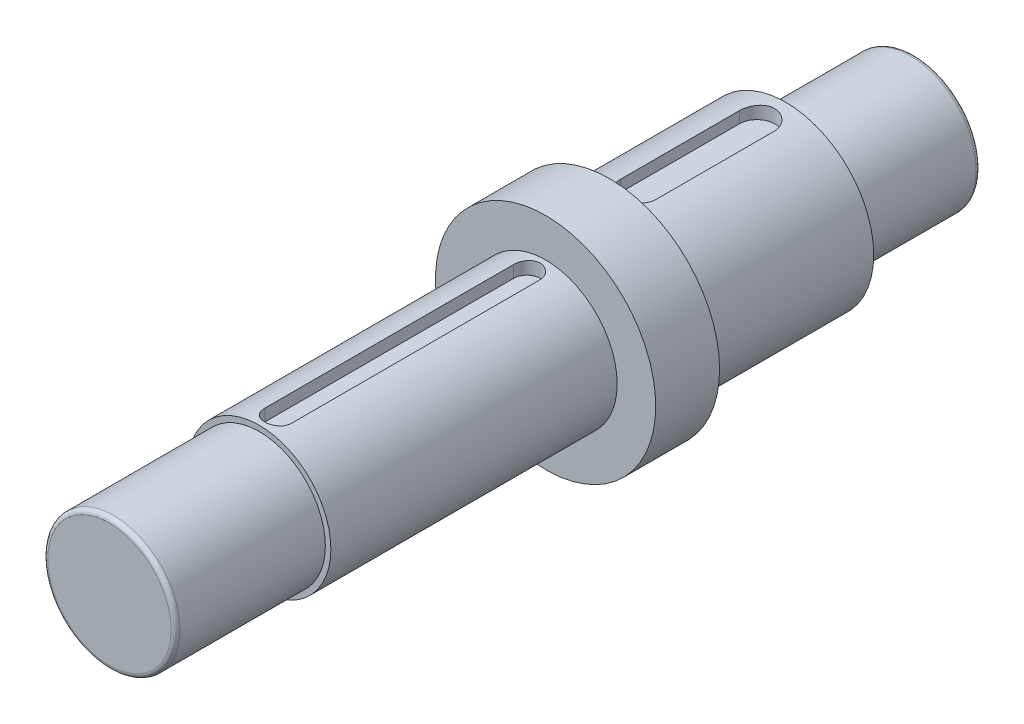
ISO-10303-21;
HEADER;
FILE_DESCRIPTION(('STEP AP214'),'2;1');
FILE_NAME('part.step','',(''),(''),'','','');
FILE_SCHEMA(('AUTOMOTIVE_DESIGN { 1 0 10303 214 1 1 1 1 }'));
ENDSEC;
DATA;
#1=APPLICATION_CONTEXT('core data for automotive mechanical design processes');
#2=APPLICATION_PROTOCOL_DEFINITION('international standard','automotive_design',2000,#1);
#3=PRODUCT_CONTEXT('',#1,'mechanical');
#4=PRODUCT('Part','Part','',(#3));
#5=PRODUCT_RELATED_PRODUCT_CATEGORY('part','',(#4));
#6=PRODUCT_DEFINITION_FORMATION('','',#4);
#7=PRODUCT_DEFINITION_CONTEXT('part definition',#1,'design');
#8=PRODUCT_DEFINITION('design','',#6,#7);
#9=PRODUCT_DEFINITION_SHAPE('','',#8);
#10=(LENGTH_UNIT() NAMED_UNIT(*) SI_UNIT(.MILLI.,.METRE.));
#11=(NAMED_UNIT(*) PLANE_ANGLE_UNIT() SI_UNIT($,.RADIAN.));
#12=(NAMED_UNIT(*) SI_UNIT($,.STERADIAN.) SOLID_ANGLE_UNIT());
#13=UNCERTAINTY_MEASURE_WITH_UNIT(LENGTH_MEASURE(1.E-05),#10,'distance_accuracy_value','');
#14=(GEOMETRIC_REPRESENTATION_CONTEXT(3) GLOBAL_UNCERTAINTY_ASSIGNED_CONTEXT((#13)) GLOBAL_UNIT_ASSIGNED_CONTEXT((#10,
#11,#12)) REPRESENTATION_CONTEXT('',''));
#15=CARTESIAN_POINT('',(0.,0.,0.));
#16=DIRECTION('',(0.,0.,1.));
#17=DIRECTION('',(1.,0.,0.));
#18=AXIS2_PLACEMENT_3D('',#15,#16,#17);
#19=CARTESIAN_POINT('',(0.,0.,0.));
#20=DIRECTION('',(0.,0.,1.));
#21=DIRECTION('',(1.,0.,0.));
#22=AXIS2_PLACEMENT_3D('',#19,#20,#21);
#23=CYLINDRICAL_SURFACE('',#22,32.5);
#24=CARTESIAN_POINT('',(0.,0.,167.5));
#25=DIRECTION('',(0.,0.,1.));
#26=DIRECTION('',(1.,0.,0.));
#27=AXIS2_PLACEMENT_3D('',#24,#25,#26);
#28=CIRCLE('',#27,32.5);
#29=CARTESIAN_POINT('',(32.5,0.,167.5));
#30=VERTEX_POINT('',#29);
#31=EDGE_CURVE('E170',#30,#30,#28,.T.);
#32=ORIENTED_EDGE('',*,*,#31,.T.);
#33=EDGE_LOOP('',(#32));
#34=FACE_BOUND('',#33,.T.);
#35=CARTESIAN_POINT('',(0.,0.,297.5));
#36=DIRECTION('',(0.,0.,1.));
#37=DIRECTION('',(1.,0.,0.));
#38=AXIS2_PLACEMENT_3D('',#35,#36,#37);
#39=CIRCLE('',#38,32.5);
#40=CARTESIAN_POINT('',(32.5,0.,297.5));
#41=VERTEX_POINT('',#40);
#42=EDGE_CURVE('E173',#41,#41,#39,.T.);
#43=ORIENTED_EDGE('',*,*,#42,.F.);
#44=EDGE_LOOP('',(#43));
#45=FACE_BOUND('',#44,.T.);
#46=CARTESIAN_POINT('',(5.99999999999991,31.9413525073689,176.));
#47=CARTESIAN_POINT('',(6.00001972804641,31.9413387857947,175.832781755872));
#48=CARTESIAN_POINT('',(5.9930103732358,31.9426651643651,175.665568298779));
#49=CARTESIAN_POINT('',(5.96507748310387,31.9478985744651,175.33236641655));
#50=CARTESIAN_POINT('',(5.94415550928292,31.951805316384,175.16637785605));
#51=CARTESIAN_POINT('',(5.88858022552652,31.9620927431616,174.837033794825));
#52=CARTESIAN_POINT('',(5.85394617497402,31.9684699578331,174.673674934018));
#53=CARTESIAN_POINT('',(5.77122142179083,31.9835079502799,174.350509489182));
#54=CARTESIAN_POINT('',(5.72313069754881,31.9921687317226,174.190702910859));
#55=CARTESIAN_POINT('',(5.6138585652119,32.0115239309396,173.87576503055));
#56=CARTESIAN_POINT('',(5.55267764101723,32.0222182735384,173.720633555985));
#57=CARTESIAN_POINT('',(5.41765280752458,32.0453386476663,173.41604968961));
#58=CARTESIAN_POINT('',(5.34380421506806,32.0577653193071,173.26659942316));
#59=CARTESIAN_POINT('',(5.18401841837613,32.0839913654135,172.974498719593));
#60=CARTESIAN_POINT('',(5.09808515477464,32.0977902919789,172.831846086089));
#61=CARTESIAN_POINT('',(4.91468141870748,32.126383548917,172.554190990731));
#62=CARTESIAN_POINT('',(4.81720664599399,32.1411782494131,172.419191408204));
#63=CARTESIAN_POINT('',(4.61035013215909,32.1715045920759,172.156444905818));
#64=CARTESIAN_POINT('',(4.500855772139,32.187042269054,172.028787333283));
#65=CARTESIAN_POINT('',(4.27151002693483,32.2182804790527,171.783075009634));
#66=CARTESIAN_POINT('',(4.15165482004194,32.2339810702705,171.665023833381));
#67=CARTESIAN_POINT('',(3.90246404243743,32.2650977553358,171.439405957197));
#68=CARTESIAN_POINT('',(3.77313048808002,32.280513908824,171.331837038625));
#69=CARTESIAN_POINT('',(3.50578787076281,32.3106414262999,171.127861732948));
#70=CARTESIAN_POINT('',(3.36777562726992,32.3253525283815,171.031459475376));
#71=CARTESIAN_POINT('',(3.08306099946307,32.3537531221654,170.84990878919));
#72=CARTESIAN_POINT('',(2.936304463415,32.3674347266049,170.764844016585));
#73=CARTESIAN_POINT('',(2.63595403307188,32.39327817288,170.607365279224));
#74=CARTESIAN_POINT('',(2.48235760661719,32.4054394454306,170.534956049293));
#75=CARTESIAN_POINT('',(2.16953912880609,32.4278842146267,170.403404977647));
#76=CARTESIAN_POINT('',(2.01031985951629,32.43816862479,170.344256678271));
#77=CARTESIAN_POINT('',(1.6872662257965,32.4565758245332,170.239620637345));
#78=CARTESIAN_POINT('',(1.52343020954708,32.4646978292852,170.19413785482));
#79=CARTESIAN_POINT('',(1.19428937290297,32.4784619635949,170.117662795038));
#80=CARTESIAN_POINT('',(1.02902285551296,32.4841314254946,170.08651054924));
#81=CARTESIAN_POINT('',(0.696389660835666,32.4929641670952,170.038180964307));
#82=CARTESIAN_POINT('',(0.529022963736015,32.4961274231355,170.021003757107));
#83=CARTESIAN_POINT('',(0.193419088173478,32.4998576642738,170.000762755366));
#84=CARTESIAN_POINT('',(0.0251819603747735,32.5004247988165,169.997698148437));
#85=CARTESIAN_POINT('',(-0.310943540652088,32.4989470467579,170.005704820769));
#86=CARTESIAN_POINT('',(-0.4788319159249,32.4969021755137,170.016776016919));
#87=CARTESIAN_POINT('',(-0.811000792294051,32.4902991463823,170.052744707521));
#88=CARTESIAN_POINT('',(-0.975300336608197,32.4857718718836,170.077472330134));
#89=CARTESIAN_POINT('',(-1.3012016725665,32.4743508081301,170.140442175259));
#90=CARTESIAN_POINT('',(-1.46280351116901,32.4674570601131,170.178684162273));
#91=CARTESIAN_POINT('',(-1.78221456789494,32.4514913115269,170.268400289348));
#92=CARTESIAN_POINT('',(-1.94002302319782,32.4424188768056,170.319877066883));
#93=CARTESIAN_POINT('',(-2.25067218859326,32.422348706553,170.435654353196));
#94=CARTESIAN_POINT('',(-2.40351461351373,32.4113516441784,170.499950379413));
#95=CARTESIAN_POINT('',(-2.70413221736005,32.3876602669359,170.641322955232));
#96=CARTESIAN_POINT('',(-2.85187246890169,32.3749563872849,170.718472164102));
#97=CARTESIAN_POINT('',(-3.14028729035266,32.3482544525693,170.884700366781));
#98=CARTESIAN_POINT('',(-3.28096432628655,32.3342568541064,170.973775156549));
#99=CARTESIAN_POINT('',(-3.55442520770943,32.3053397564869,171.163291713638));
#100=CARTESIAN_POINT('',(-3.68720582162271,32.2904198849195,171.26373808656));
#101=CARTESIAN_POINT('',(-3.94388427294111,32.2600755738219,171.475243396471));
#102=CARTESIAN_POINT('',(-4.06778521841465,32.2446513136185,171.586298588086));
#103=CARTESIAN_POINT('',(-4.30773837389128,32.2134793446507,171.820063598722));
#104=CARTESIAN_POINT('',(-4.42364336885938,32.1977302742279,171.942924401806));
#105=CARTESIAN_POINT('',(-4.64466655714656,32.166590238664,172.197956367049));
#106=CARTESIAN_POINT('',(-4.74978862891945,32.1511991463148,172.330124152576));
#107=CARTESIAN_POINT('',(-4.94862562431096,32.1211958688334,172.60299810796));
#108=CARTESIAN_POINT('',(-5.04233297220692,32.1065842045683,172.743709856458));
#109=CARTESIAN_POINT('',(-5.21755652220308,32.0785750424357,173.03257199706));
#110=CARTESIAN_POINT('',(-5.29907734790028,32.0651770848488,173.180719539362));
#111=CARTESIAN_POINT('',(-5.4495670127457,32.0399447422428,173.483866269052));
#112=CARTESIAN_POINT('',(-5.51850301951117,32.0281144685451,173.638882103259));
#113=CARTESIAN_POINT('',(-5.64301783414208,32.0064110019808,173.954253678406));
#114=CARTESIAN_POINT('',(-5.69860183057835,31.996537049153,174.114607317412));
#115=CARTESIAN_POINT('',(-5.79596382074337,31.9790439211199,174.439386223656));
#116=CARTESIAN_POINT('',(-5.83775626999942,31.9714223859376,174.60380703229));
#117=CARTESIAN_POINT('',(-5.90726811971032,31.9586519303727,174.935623501661));
#118=CARTESIAN_POINT('',(-5.9349942414404,31.9535018291353,175.103017701979));
#119=CARTESIAN_POINT('',(-5.97038248093272,31.9469053541025,175.392231253542));
#120=CARTESIAN_POINT('',(-5.98149459292176,31.9448246568417,175.513625510117));
#121=CARTESIAN_POINT('',(-5.99629903533955,31.9420477031673,175.756676055159));
#122=CARTESIAN_POINT('',(-6.00000382610286,31.9413491218277,175.878331558387));
#123=CARTESIAN_POINT('',(-5.99999999999999,31.9413525073689,176.));
#124=B_SPLINE_CURVE_WITH_KNOTS('',3,(#46,#47,#48,#49,#50,#51,#52,#53,#54,#55,#56,#57,#58,#59,
#60,#61,#62,#63,#64,#65,#66,#67,#68,#69,#70,#71,#72,#73,#74,#75,#76,#77,#78,#79,#80,#81,#82,#83,
#84,#85,#86,#87,#88,#89,#90,#91,#92,#93,#94,#95,#96,#97,#98,#99,#100,#101,#102,#103,#104,#105,
#106,#107,#108,#109,#110,#111,#112,#113,#114,#115,#116,#117,#118,#119,#120,#121,#122,#123),
.UNSPECIFIED.,.F.,.F.,(4,2,2,2,2,2,2,2,2,2,2,2,2,2,2,2,2,2,2,2,2,2,2,2,2,2,2,2,2,2,2,2,2,2,2,2,
2,2,4),(0.,0.501495470760242,1.00293466504055,1.50367204425038,2.0044102276453,2.50512990364764,
3.00603509315038,3.50677732194071,4.0077067127393,4.51381178473909,5.02010434213718,
5.52628950547204,6.03266126710335,6.54258387789146,7.05269685982352,7.5625608904048,
8.07260972061943,8.57681791670589,9.08103087289818,9.58521480389387,10.0893957705871,
10.5874420693422,11.0854796896586,11.5836166376145,12.08157970439,12.5824597292726,
13.083163645103,13.5840710813184,14.0848023244559,14.5931139762334,15.1012421501451,
15.6097057420661,16.117975929331,16.6275537557709,17.136933239535,17.6457771118127,
18.1543776150575,18.5199145679152,18.8848361083195),.UNSPECIFIED.);
#125=CARTESIAN_POINT('',(5.99999999999994,31.9413525073689,176.));
#126=VERTEX_POINT('',#125);
#127=CARTESIAN_POINT('',(-5.99999999999996,31.9413525073689,176.));
#128=VERTEX_POINT('',#127);
#129=EDGE_CURVE('E11',#126,#128,#124,.T.);
#130=ORIENTED_EDGE('',*,*,#129,.F.);
#131=DIRECTION('',(0.,0.,1.));
#132=VECTOR('',#131,1.);
#133=CARTESIAN_POINT('',(5.99999999999991,31.9413525073689,0.));
#134=LINE('',#133,#132);
#135=CARTESIAN_POINT('',(5.99999999999991,31.9413525073689,289.));
#136=VERTEX_POINT('',#135);
#137=EDGE_CURVE('E231',#136,#126,#134,.F.);
#138=ORIENTED_EDGE('',*,*,#137,.F.);
#139=CARTESIAN_POINT('',(-5.99999999999997,31.9413525073689,289.));
#140=CARTESIAN_POINT('',(-6.00001972804647,31.9413387857947,289.167218244128));
#141=CARTESIAN_POINT('',(-5.99301037323586,31.9426651643651,289.334431701221));
#142=CARTESIAN_POINT('',(-5.96507748310392,31.9478985744651,289.66763358345));
#143=CARTESIAN_POINT('',(-5.94415550928297,31.951805316384,289.83362214395));
#144=CARTESIAN_POINT('',(-5.88858022552657,31.9620927431616,290.162966205175));
#145=CARTESIAN_POINT('',(-5.85394617497407,31.9684699578331,290.326325065982));
#146=CARTESIAN_POINT('',(-5.77122142179087,31.9835079502799,290.649490510818));
#147=CARTESIAN_POINT('',(-5.72313069754886,31.9921687317226,290.809297089141));
#148=CARTESIAN_POINT('',(-5.61385856521194,32.0115239309396,291.12423496945));
#149=CARTESIAN_POINT('',(-5.55267764101726,32.0222182735384,291.279366444015));
#150=CARTESIAN_POINT('',(-5.41765280752461,32.0453386476662,291.58395031039));
#151=CARTESIAN_POINT('',(-5.34380421506808,32.0577653193071,291.733400576841));
#152=CARTESIAN_POINT('',(-5.18401841837614,32.0839913654135,292.025501280407));
#153=CARTESIAN_POINT('',(-5.09808515477463,32.0977902919789,292.168153913911));
#154=CARTESIAN_POINT('',(-4.91468141870748,32.126383548917,292.445809009269));
#155=CARTESIAN_POINT('',(-4.81720664599399,32.1411782494131,292.580808591796));
#156=CARTESIAN_POINT('',(-4.61035013215911,32.1715045920759,292.843555094182));
#157=CARTESIAN_POINT('',(-4.50085577213901,32.187042269054,292.971212666717));
#158=CARTESIAN_POINT('',(-4.27151002693485,32.2182804790527,293.216924990366));
#159=CARTESIAN_POINT('',(-4.15165482004196,32.2339810702705,293.33497616662));
#160=CARTESIAN_POINT('',(-3.90246404243746,32.2650977553358,293.560594042803));
#161=CARTESIAN_POINT('',(-3.77313048808004,32.280513908824,293.668162961375));
#162=CARTESIAN_POINT('',(-3.50578787076284,32.3106414262999,293.872138267052));
#163=CARTESIAN_POINT('',(-3.36777562726996,32.3253525283815,293.968540524624));
#164=CARTESIAN_POINT('',(-3.08306099946311,32.3537531221654,294.15009121081));
#165=CARTESIAN_POINT('',(-2.93630446341504,32.3674347266048,294.235155983415));
#166=CARTESIAN_POINT('',(-2.6359540330719,32.39327817288,294.392634720776));
#167=CARTESIAN_POINT('',(-2.48235760661721,32.4054394454306,294.465043950707));
#168=CARTESIAN_POINT('',(-2.1695391288061,32.4278842146267,294.596595022353));
#169=CARTESIAN_POINT('',(-2.0103198595163,32.43816862479,294.655743321729));
#170=CARTESIAN_POINT('',(-1.68726622579652,32.4565758245332,294.760379362655));
#171=CARTESIAN_POINT('',(-1.52343020954711,32.4646978292852,294.80586214518));
#172=CARTESIAN_POINT('',(-1.19428937290301,32.4784619635949,294.882337204962));
#173=CARTESIAN_POINT('',(-1.029022855513,32.4841314254946,294.91348945076));
#174=CARTESIAN_POINT('',(-0.696389660835696,32.4929641670952,294.961819035693));
#175=CARTESIAN_POINT('',(-0.529022963736039,32.4961274231355,294.978996242893));
#176=CARTESIAN_POINT('',(-0.193419088173493,32.4998576642738,294.999237244634));
#177=CARTESIAN_POINT('',(-0.0251819603747849,32.5004247988165,295.002301851563));
#178=CARTESIAN_POINT('',(0.310943540652082,32.4989470467579,294.994295179231));
#179=CARTESIAN_POINT('',(0.478831915924895,32.4969021755137,294.983223983081));
#180=CARTESIAN_POINT('',(0.811000792294054,32.4902991463823,294.947255292478));
#181=CARTESIAN_POINT('',(0.975300336608206,32.4857718718836,294.922527669866));
#182=CARTESIAN_POINT('',(1.30120167256651,32.4743508081301,294.859557824741));
#183=CARTESIAN_POINT('',(1.46280351116901,32.4674570601131,294.821315837727));
#184=CARTESIAN_POINT('',(1.78221456789493,32.4514913115269,294.731599710652));
#185=CARTESIAN_POINT('',(1.9400230231978,32.4424188768056,294.680122933117));
#186=CARTESIAN_POINT('',(2.25067218859324,32.422348706553,294.564345646804));
#187=CARTESIAN_POINT('',(2.40351461351371,32.4113516441784,294.500049620587));
#188=CARTESIAN_POINT('',(2.70413221736002,32.3876602669359,294.358677044768));
#189=CARTESIAN_POINT('',(2.85187246890166,32.3749563872849,294.281527835897));
#190=CARTESIAN_POINT('',(3.14028729035262,32.3482544525693,294.115299633219));
#191=CARTESIAN_POINT('',(3.28096432628651,32.3342568541064,294.026224843451));
#192=CARTESIAN_POINT('',(3.55442520770939,32.3053397564869,293.836708286362));
#193=CARTESIAN_POINT('',(3.68720582162266,32.2904198849195,293.73626191344));
#194=CARTESIAN_POINT('',(3.94388427294107,32.2600755738219,293.524756603529));
#195=CARTESIAN_POINT('',(4.06778521841462,32.2446513136185,293.413701411914));
#196=CARTESIAN_POINT('',(4.30773837389127,32.2134793446507,293.179936401278));
#197=CARTESIAN_POINT('',(4.42364336885937,32.1977302742279,293.057075598194));
#198=CARTESIAN_POINT('',(4.64466655714654,32.166590238664,292.802043632951));
#199=CARTESIAN_POINT('',(4.74978862891943,32.1511991463148,292.669875847424));
#200=CARTESIAN_POINT('',(4.94862562431094,32.1211958688334,292.39700189204));
#201=CARTESIAN_POINT('',(5.04233297220689,32.1065842045684,292.256290143541));
#202=CARTESIAN_POINT('',(5.21755652220306,32.0785750424357,291.96742800294));
#203=CARTESIAN_POINT('',(5.29907734790027,32.0651770848488,291.819280460638));
#204=CARTESIAN_POINT('',(5.44956701274567,32.0399447422428,291.516133730948));
#205=CARTESIAN_POINT('',(5.51850301951113,32.0281144685451,291.361117896741));
#206=CARTESIAN_POINT('',(5.64301783414201,32.0064110019808,291.045746321594));
#207=CARTESIAN_POINT('',(5.6986018305783,31.996537049153,290.885392682588));
#208=CARTESIAN_POINT('',(5.79596382074332,31.9790439211199,290.560613776344));
#209=CARTESIAN_POINT('',(5.83775626999936,31.9714223859376,290.39619296771));
#210=CARTESIAN_POINT('',(5.90726811971026,31.9586519303727,290.064376498339));
#211=CARTESIAN_POINT('',(5.93499424144035,31.9535018291353,289.896982298021));
#212=CARTESIAN_POINT('',(5.97038248093266,31.9469053541026,289.607768746458));
#213=CARTESIAN_POINT('',(5.9814945929217,31.9448246568418,289.486374489883));
#214=CARTESIAN_POINT('',(5.9962990353395,31.9420477031673,289.243323944841));
#215=CARTESIAN_POINT('',(6.00000382610281,31.9413491218277,289.121668441613));
#216=CARTESIAN_POINT('',(5.99999999999993,31.9413525073689,289.));
#217=B_SPLINE_CURVE_WITH_KNOTS('',3,(#139,#140,#141,#142,#143,#144,#145,#146,#147,#148,#149,
#150,#151,#152,#153,#154,#155,#156,#157,#158,#159,#160,#161,#162,#163,#164,#165,#166,#167,#168,
#169,#170,#171,#172,#173,#174,#175,#176,#177,#178,#179,#180,#181,#182,#183,#184,#185,#186,#187,
#188,#189,#190,#191,#192,#193,#194,#195,#196,#197,#198,#199,#200,#201,#202,#203,#204,#205,#206,
#207,#208,#209,#210,#211,#212,#213,#214,#215,#216),.UNSPECIFIED.,.F.,.F.,(4,2,2,2,2,2,2,2,2,2,2,
2,2,2,2,2,2,2,2,2,2,2,2,2,2,2,2,2,2,2,2,2,2,2,2,2,2,2,4),(0.,0.501495470760297,1.00293466504058,
1.50367204425046,2.00441022764533,2.5051299036477,3.00603509315047,3.50677732194082,
4.00770671273937,4.51381178473916,5.02010434213722,5.52628950547208,6.03266126710339,
6.54258387789147,7.05269685982357,7.56256089040485,8.07260972061946,8.5768179167059,
9.08103087289821,9.58521480389392,10.0893957705872,10.5874420693423,11.0854796896587,
11.5836166376145,12.0815797043901,12.5824597292726,13.083163645103,13.5840710813184,
14.0848023244559,14.5931139762334,15.1012421501452,15.6097057420662,16.117975929331,
16.6275537557709,17.1369332395349,17.6457771118127,18.1543776150576,18.5199145679151,
18.8848361083195),.UNSPECIFIED.);
#218=CARTESIAN_POINT('',(-5.99999999999997,31.9413525073689,289.));
#219=VERTEX_POINT('',#218);
#220=EDGE_CURVE('E233',#219,#136,#217,.T.);
#221=ORIENTED_EDGE('',*,*,#220,.F.);
#222=DIRECTION('',(0.,0.,1.));
#223=VECTOR('',#222,1.);
#224=CARTESIAN_POINT('',(-5.99999999999999,31.9413525073689,0.));
#225=LINE('',#224,#223);
#226=EDGE_CURVE('E49',#128,#219,#225,.T.);
#227=ORIENTED_EDGE('',*,*,#226,.F.);
#228=EDGE_LOOP('',(#130,#138,#221,#227));
#229=FACE_BOUND('',#228,.T.);
#230=ADVANCED_FACE('F35',(#34,#45,#229),#23,.T.);
#231=CARTESIAN_POINT('',(0.,0.,0.));
#232=DIRECTION('',(0.,0.,1.));
#233=DIRECTION('',(1.,0.,0.));
#234=AXIS2_PLACEMENT_3D('',#231,#232,#233);
#235=CYLINDRICAL_SURFACE('',#234,40.);
#236=CARTESIAN_POINT('',(0.,0.,58.5));
#237=DIRECTION('',(0.,0.,1.));
#238=DIRECTION('',(1.,0.,0.));
#239=AXIS2_PLACEMENT_3D('',#236,#237,#238);
#240=CIRCLE('',#239,40.);
#241=CARTESIAN_POINT('',(40.,0.,58.5));
#242=VERTEX_POINT('',#241);
#243=EDGE_CURVE('E158',#242,#242,#240,.T.);
#244=ORIENTED_EDGE('',*,*,#243,.T.);
#245=EDGE_LOOP('',(#244));
#246=FACE_BOUND('',#245,.T.);
#247=CARTESIAN_POINT('',(0.,0.,138.5));
#248=DIRECTION('',(0.,0.,1.));
#249=DIRECTION('',(1.,0.,0.));
#250=AXIS2_PLACEMENT_3D('',#247,#248,#249);
#251=CIRCLE('',#250,40.);
#252=CARTESIAN_POINT('',(40.,0.,138.5));
#253=VERTEX_POINT('',#252);
#254=EDGE_CURVE('E161',#253,#253,#251,.T.);
#255=ORIENTED_EDGE('',*,*,#254,.F.);
#256=EDGE_LOOP('',(#255));
#257=FACE_BOUND('',#256,.T.);
#258=CARTESIAN_POINT('',(7.99999999999996,39.1918358845309,71.5));
#259=CARTESIAN_POINT('',(8.00002666922668,39.1918159431797,71.2773994773631));
#260=CARTESIAN_POINT('',(7.99071035587004,39.1937316873133,71.0548058559555));
#261=CARTESIAN_POINT('',(7.95358673509773,39.2012897767833,70.6112562503618));
#262=CARTESIAN_POINT('',(7.92578171511928,39.2069316611182,70.3903000670098));
#263=CARTESIAN_POINT('',(7.85193172751173,39.2217860307119,69.9519267033541));
#264=CARTESIAN_POINT('',(7.80591454667937,39.2309930760462,69.7345046546017));
#265=CARTESIAN_POINT('',(7.6960105112746,39.2527015332246,69.3043945517376));
#266=CARTESIAN_POINT('',(7.63212358375307,39.2652029585174,69.0917065169553));
#267=CARTESIAN_POINT('',(7.48697595827944,39.2931373309787,68.6725672642705));
#268=CARTESIAN_POINT('',(7.40571689392711,39.3085700024906,68.4661154620218));
#269=CARTESIAN_POINT('',(7.22639517936945,39.3419309258448,68.0607634761196));
#270=CARTESIAN_POINT('',(7.12832631202955,39.359860100561,67.8618661198586));
#271=CARTESIAN_POINT('',(6.9161440468189,39.3976973294659,67.473092957701));
#272=CARTESIAN_POINT('',(6.80203505304725,39.4176048400293,67.2832146945358));
#273=CARTESIAN_POINT('',(6.55850947336996,39.4588545756894,66.9136125839657));
#274=CARTESIAN_POINT('',(6.42908748099434,39.4801973063558,66.7338923562906));
#275=CARTESIAN_POINT('',(6.15415578885209,39.5239924026978,66.3836992170384));
#276=CARTESIAN_POINT('',(6.00846658612044,39.5464552423725,66.2133685158621));
#277=CARTESIAN_POINT('',(5.70333270732971,39.5916124451561,65.8855417537508));
#278=CARTESIAN_POINT('',(5.54388793819493,39.6143068098307,65.7280457796746));
#279=CARTESIAN_POINT('',(5.21226662634081,39.6593025376983,65.4269071968093));
#280=CARTESIAN_POINT('',(5.0400860521929,39.6816037736592,65.2832690080446));
#281=CARTESIAN_POINT('',(4.6842537554729,39.7251794083479,65.0109364355222));
#282=CARTESIAN_POINT('',(4.50060577967097,39.7464541384826,64.8822372096095));
#283=CARTESIAN_POINT('',(4.12134325254234,39.7875762988249,64.6395582052914));
#284=CARTESIAN_POINT('',(3.92563673340869,39.8074093383913,64.5257196477843));
#285=CARTESIAN_POINT('',(3.52511574724929,39.8448742915997,64.3149623081856));
#286=CARTESIAN_POINT('',(3.32030141044038,39.8625062366975,64.2180432842886));
#287=CARTESIAN_POINT('',(2.90302705629154,39.8950650833092,64.0418691041571));
#288=CARTESIAN_POINT('',(2.690567847596,39.9099922699196,63.9626120860474));
#289=CARTESIAN_POINT('',(2.25951457252046,39.9367151389395,63.8223728290361));
#290=CARTESIAN_POINT('',(2.04092072388619,39.948510932341,63.7613899423989));
#291=CARTESIAN_POINT('',(1.6020566050941,39.9685005509805,63.6588563748557));
#292=CARTESIAN_POINT('',(1.3818448434766,39.9767391064403,63.6170639331187));
#293=CARTESIAN_POINT('',(0.938668501096503,39.9895989229295,63.5521048244742));
#294=CARTESIAN_POINT('',(0.715704977800294,39.9942215320969,63.528931215795));
#295=CARTESIAN_POINT('',(0.268546453942566,39.9997235457757,63.5013709436081));
#296=CARTESIAN_POINT('',(0.0443513071851338,40.0006024958556,63.4969865608674));
#297=CARTESIAN_POINT('',(-0.403598136420523,39.998590885801,63.5070470189472));
#298=CARTESIAN_POINT('',(-0.627352436688717,39.9957003550254,63.5214917131161));
#299=CARTESIAN_POINT('',(-1.06956087762931,39.9863007164749,63.5687472698706));
#300=CARTESIAN_POINT('',(-1.28804488719503,39.9798444941963,63.6012897581708));
#301=CARTESIAN_POINT('',(-1.72152774938216,39.9635259160648,63.6843068948711));
#302=CARTESIAN_POINT('',(-1.93652536613346,39.9536623788616,63.7347877628625));
#303=CARTESIAN_POINT('',(-2.36138711377734,39.9308038729487,63.8532704931489));
#304=CARTESIAN_POINT('',(-2.57125292637828,39.9178099456462,63.9212665290794));
#305=CARTESIAN_POINT('',(-2.98456033438454,39.8890377494063,64.0743028246649));
#306=CARTESIAN_POINT('',(-3.18799963056057,39.8732584969652,64.1593491062397));
#307=CARTESIAN_POINT('',(-3.58823088504013,39.839241787259,64.3464209443809));
#308=CARTESIAN_POINT('',(-3.78497444405911,39.8209898525271,64.4485473994331));
#309=CARTESIAN_POINT('',(-4.16917750443027,39.7825996820114,64.6686766972977));
#310=CARTESIAN_POINT('',(-4.35663686412197,39.7624614174589,64.7866797822573));
#311=CARTESIAN_POINT('',(-4.7210696357989,39.7208402552586,65.0377654019578));
#312=CARTESIAN_POINT('',(-4.89804077202868,39.6993570678511,65.1708511912621));
#313=CARTESIAN_POINT('',(-5.24023924452892,39.6556382273803,65.4511328809067));
#314=CARTESIAN_POINT('',(-5.40547013631541,39.6334028051675,65.5983244773327));
#315=CARTESIAN_POINT('',(-5.72594829962104,39.5883841709058,65.9085672169155));
#316=CARTESIAN_POINT('',(-5.88097018343544,39.5655981831912,66.0718508738712));
#317=CARTESIAN_POINT('',(-6.1767327183542,39.52050553126,66.4109346312084));
#318=CARTESIAN_POINT('',(-6.31747353175153,39.4981988615986,66.5867345893135));
#319=CARTESIAN_POINT('',(-6.58373833819255,39.4546904604362,66.9497178575182));
#320=CARTESIAN_POINT('',(-6.70925765808143,39.4334890694003,67.1369046371365));
#321=CARTESIAN_POINT('',(-6.94413000109325,39.3928073388215,67.5213326337773));
#322=CARTESIAN_POINT('',(-7.05348345869363,39.3733269530302,67.7185735803901));
#323=CARTESIAN_POINT('',(-7.25551976501701,39.3365988941848,68.1223463687289));
#324=CARTESIAN_POINT('',(-7.34815287597922,39.319357923992,68.328903717907));
#325=CARTESIAN_POINT('',(-7.51561296401807,39.2876930641819,68.7492329719979));
#326=CARTESIAN_POINT('',(-7.59044689691486,39.2732680744913,68.9630020212031));
#327=CARTESIAN_POINT('',(-7.72169650413227,39.2476734918111,69.3960643964984));
#328=CARTESIAN_POINT('',(-7.77813137524138,39.2365005071337,69.6153517060011));
#329=CARTESIAN_POINT('',(-7.8722129784336,39.217732786038,70.0579800459995));
#330=CARTESIAN_POINT('',(-7.90986864539154,39.2101363480467,70.2813190962134));
#331=CARTESIAN_POINT('',(-7.95864886653906,39.200259679954,70.6708147229986));
#332=CARTESIAN_POINT('',(-7.97416273216954,39.1971035385051,70.8364132290699));
#333=CARTESIAN_POINT('',(-7.99483261811853,39.192890643088,71.168002768873));
#334=CARTESIAN_POINT('',(-8.00000597259349,39.1918303757664,71.333992677912));
#335=CARTESIAN_POINT('',(-7.99999999999999,39.1918358845308,71.5));
#336=B_SPLINE_CURVE_WITH_KNOTS('',3,(#258,#259,#260,#261,#262,#263,#264,#265,#266,#267,#268,
#269,#270,#271,#272,#273,#274,#275,#276,#277,#278,#279,#280,#281,#282,#283,#284,#285,#286,#287,
#288,#289,#290,#291,#292,#293,#294,#295,#296,#297,#298,#299,#300,#301,#302,#303,#304,#305,#306,
#307,#308,#309,#310,#311,#312,#313,#314,#315,#316,#317,#318,#319,#320,#321,#322,#323,#324,#325,
#326,#327,#328,#329,#330,#331,#332,#333,#334,#335),.UNSPECIFIED.,.F.,.F.,(4,2,2,2,2,2,2,2,2,2,2,
2,2,2,2,2,2,2,2,2,2,2,2,2,2,2,2,2,2,2,2,2,2,2,2,2,2,2,4),(0.,0.667588082863367,1.33509358657229,
2.00158456075836,2.66807825577952,3.3345093041942,4.00118736722488,4.66768273830515,
5.33441413112672,6.00940860933874,6.68440765519393,7.3596212891945,8.03461545192918,
8.71561799719683,9.39661080912295,10.0775317988518,10.7584286501498,11.4304948903323,
12.1023104435848,12.7742075441763,13.4460994116817,14.108283619839,14.7706976447376,
15.4328916036424,16.0953198539646,16.7618092594033,17.4283088311614,18.0949524957899,
18.7613934001529,19.4395000800169,20.1175990528765,20.7959056848448,21.4741940831724,
22.1544680675848,22.8344757662838,23.5137716866302,24.1927440986813,24.6914848131908,
25.1893887678565),.UNSPECIFIED.);
#337=CARTESIAN_POINT('',(7.99999999999997,39.1918358845309,71.5));
#338=VERTEX_POINT('',#337);
#339=CARTESIAN_POINT('',(-7.99999999999998,39.1918358845308,71.5));
#340=VERTEX_POINT('',#339);
#341=EDGE_CURVE('E225',#338,#340,#336,.T.);
#342=ORIENTED_EDGE('',*,*,#341,.F.);
#343=DIRECTION('',(0.,0.,1.));
#344=VECTOR('',#343,1.);
#345=CARTESIAN_POINT('',(7.99999999999996,39.1918358845309,0.));
#346=LINE('',#345,#344);
#347=CARTESIAN_POINT('',(7.99999999999996,39.1918358845309,125.5));
#348=VERTEX_POINT('',#347);
#349=EDGE_CURVE('E191',#348,#338,#346,.F.);
#350=ORIENTED_EDGE('',*,*,#349,.F.);
#351=CARTESIAN_POINT('',(-7.99999999999998,39.1918358845308,125.5));
#352=CARTESIAN_POINT('',(-8.00002666922671,39.1918159431797,125.722600522637));
#353=CARTESIAN_POINT('',(-7.99071035587006,39.1937316873133,125.945194144045));
#354=CARTESIAN_POINT('',(-7.95358673509776,39.2012897767833,126.388743749638));
#355=CARTESIAN_POINT('',(-7.92578171511931,39.2069316611182,126.60969993299));
#356=CARTESIAN_POINT('',(-7.85193172751176,39.2217860307119,127.048073296646));
#357=CARTESIAN_POINT('',(-7.80591454667941,39.2309930760462,127.265495345398));
#358=CARTESIAN_POINT('',(-7.69601051127463,39.2527015332246,127.695605448262));
#359=CARTESIAN_POINT('',(-7.6321235837531,39.2652029585174,127.908293483045));
#360=CARTESIAN_POINT('',(-7.48697595827946,39.2931373309787,128.32743273573));
#361=CARTESIAN_POINT('',(-7.40571689392713,39.3085700024906,128.533884537978));
#362=CARTESIAN_POINT('',(-7.22639517936946,39.3419309258448,128.93923652388));
#363=CARTESIAN_POINT('',(-7.12832631202956,39.359860100561,129.138133880141));
#364=CARTESIAN_POINT('',(-6.91614404681891,39.3976973294659,129.526907042299));
#365=CARTESIAN_POINT('',(-6.80203505304726,39.4176048400293,129.716785305464));
#366=CARTESIAN_POINT('',(-6.55850947336998,39.4588545756894,130.086387416034));
#367=CARTESIAN_POINT('',(-6.42908748099436,39.4801973063558,130.266107643709));
#368=CARTESIAN_POINT('',(-6.15415578885211,39.5239924026978,130.616300782962));
#369=CARTESIAN_POINT('',(-6.00846658612045,39.5464552423725,130.786631484138));
#370=CARTESIAN_POINT('',(-5.70333270732972,39.5916124451561,131.114458246249));
#371=CARTESIAN_POINT('',(-5.54388793819493,39.6143068098307,131.271954220325));
#372=CARTESIAN_POINT('',(-5.21226662634083,39.6593025376983,131.573092803191));
#373=CARTESIAN_POINT('',(-5.04008605219292,39.6816037736592,131.716730991955));
#374=CARTESIAN_POINT('',(-4.68425375547293,39.7251794083479,131.989063564478));
#375=CARTESIAN_POINT('',(-4.50060577967099,39.7464541384826,132.117762790391));
#376=CARTESIAN_POINT('',(-4.12134325254237,39.7875762988249,132.360441794709));
#377=CARTESIAN_POINT('',(-3.92563673340871,39.8074093383913,132.474280352216));
#378=CARTESIAN_POINT('',(-3.52511574724932,39.8448742915997,132.685037691814));
#379=CARTESIAN_POINT('',(-3.3203014104404,39.8625062366975,132.781956715711));
#380=CARTESIAN_POINT('',(-2.90302705629157,39.8950650833092,132.958130895843));
#381=CARTESIAN_POINT('',(-2.69056784759603,39.9099922699196,133.037387913953));
#382=CARTESIAN_POINT('',(-2.25951457252048,39.9367151389395,133.177627170964));
#383=CARTESIAN_POINT('',(-2.04092072388621,39.948510932341,133.238610057601));
#384=CARTESIAN_POINT('',(-1.60205660509411,39.9685005509805,133.341143625144));
#385=CARTESIAN_POINT('',(-1.38184484347661,39.9767391064403,133.382936066881));
#386=CARTESIAN_POINT('',(-0.938668501096515,39.9895989229295,133.447895175526));
#387=CARTESIAN_POINT('',(-0.715704977800303,39.9942215320969,133.471068784205));
#388=CARTESIAN_POINT('',(-0.268546453942572,39.9997235457757,133.498629056392));
#389=CARTESIAN_POINT('',(-0.0443513071851389,40.0006024958556,133.503013439133));
#390=CARTESIAN_POINT('',(0.403598136420521,39.998590885801,133.492952981053));
#391=CARTESIAN_POINT('',(0.627352436688717,39.9957003550254,133.478508286884));
#392=CARTESIAN_POINT('',(1.06956087762931,39.9863007164749,133.431252730129));
#393=CARTESIAN_POINT('',(1.28804488719503,39.9798444941963,133.398710241829));
#394=CARTESIAN_POINT('',(1.72152774938216,39.9635259160648,133.315693105129));
#395=CARTESIAN_POINT('',(1.93652536613347,39.9536623788616,133.265212237138));
#396=CARTESIAN_POINT('',(2.36138711377734,39.9308038729487,133.146729506851));
#397=CARTESIAN_POINT('',(2.57125292637827,39.9178099456462,133.078733470921));
#398=CARTESIAN_POINT('',(2.98456033438453,39.8890377494063,132.925697175335));
#399=CARTESIAN_POINT('',(3.18799963056057,39.8732584969652,132.84065089376));
#400=CARTESIAN_POINT('',(3.58823088504012,39.839241787259,132.653579055619));
#401=CARTESIAN_POINT('',(3.7849744440591,39.8209898525271,132.551452600567));
#402=CARTESIAN_POINT('',(4.16917750443026,39.7825996820114,132.331323302702));
#403=CARTESIAN_POINT('',(4.35663686412197,39.7624614174589,132.213320217743));
#404=CARTESIAN_POINT('',(4.7210696357989,39.7208402552586,131.962234598042));
#405=CARTESIAN_POINT('',(4.89804077202868,39.6993570678511,131.829148808738));
#406=CARTESIAN_POINT('',(5.24023924452891,39.6556382273803,131.548867119093));
#407=CARTESIAN_POINT('',(5.4054701363154,39.6334028051675,131.401675522667));
#408=CARTESIAN_POINT('',(5.72594829962103,39.5883841709058,131.091432783084));
#409=CARTESIAN_POINT('',(5.88097018343541,39.5655981831912,130.928149126129));
#410=CARTESIAN_POINT('',(6.17673271835417,39.52050553126,130.589065368792));
#411=CARTESIAN_POINT('',(6.3174735317515,39.4981988615986,130.413265410686));
#412=CARTESIAN_POINT('',(6.58373833819253,39.4546904604362,130.050282142482));
#413=CARTESIAN_POINT('',(6.70925765808142,39.4334890694003,129.863095362863));
#414=CARTESIAN_POINT('',(6.94413000109324,39.3928073388215,129.478667366223));
#415=CARTESIAN_POINT('',(7.05348345869362,39.3733269530302,129.28142641961));
#416=CARTESIAN_POINT('',(7.255519765017,39.3365988941848,128.877653631271));
#417=CARTESIAN_POINT('',(7.3481528759792,39.319357923992,128.671096282093));
#418=CARTESIAN_POINT('',(7.51561296401805,39.2876930641819,128.250767028002));
#419=CARTESIAN_POINT('',(7.59044689691484,39.2732680744914,128.036997978797));
#420=CARTESIAN_POINT('',(7.72169650413225,39.2476734918111,127.603935603502));
#421=CARTESIAN_POINT('',(7.77813137524136,39.2365005071337,127.384648293999));
#422=CARTESIAN_POINT('',(7.87221297843358,39.217732786038,126.942019954));
#423=CARTESIAN_POINT('',(7.90986864539152,39.2101363480467,126.718680903787));
#424=CARTESIAN_POINT('',(7.95864886653903,39.200259679954,126.329185277001));
#425=CARTESIAN_POINT('',(7.97416273216952,39.1971035385051,126.16358677093));
#426=CARTESIAN_POINT('',(7.9948326181185,39.192890643088,125.831997231127));
#427=CARTESIAN_POINT('',(8.00000597259346,39.1918303757664,125.666007322088));
#428=CARTESIAN_POINT('',(7.99999999999997,39.1918358845309,125.5));
#429=B_SPLINE_CURVE_WITH_KNOTS('',3,(#351,#352,#353,#354,#355,#356,#357,#358,#359,#360,#361,
#362,#363,#364,#365,#366,#367,#368,#369,#370,#371,#372,#373,#374,#375,#376,#377,#378,#379,#380,
#381,#382,#383,#384,#385,#386,#387,#388,#389,#390,#391,#392,#393,#394,#395,#396,#397,#398,#399,
#400,#401,#402,#403,#404,#405,#406,#407,#408,#409,#410,#411,#412,#413,#414,#415,#416,#417,#418,
#419,#420,#421,#422,#423,#424,#425,#426,#427,#428),.UNSPECIFIED.,.F.,.F.,(4,2,2,2,2,2,2,2,2,2,2,
2,2,2,2,2,2,2,2,2,2,2,2,2,2,2,2,2,2,2,2,2,2,2,2,2,2,2,4),(0.,0.667588082863353,1.33509358657225,
2.00158456075833,2.66807825577954,3.33450930419424,4.00118736722492,4.66768273830515,
5.33441413112674,6.00940860933877,6.68440765519394,7.35962128919452,8.03461545192918,
8.71561799719683,9.39661080912295,10.0775317988518,10.7584286501498,11.4304948903323,
12.1023104435849,12.7742075441763,13.4460994116817,14.1082836198391,14.7706976447376,
15.4328916036424,16.0953198539646,16.7618092594033,17.4283088311615,18.0949524957899,
18.7613934001529,19.4395000800169,20.1175990528765,20.7959056848449,21.4741940831724,
22.1544680675848,22.8344757662838,23.5137716866302,24.1927440986814,24.6914848131909,
25.1893887678565),.UNSPECIFIED.);
#430=CARTESIAN_POINT('',(-7.99999999999998,39.1918358845308,125.5));
#431=VERTEX_POINT('',#430);
#432=EDGE_CURVE('E193',#431,#348,#429,.T.);
#433=ORIENTED_EDGE('',*,*,#432,.F.);
#434=DIRECTION('',(0.,0.,1.));
#435=VECTOR('',#434,1.);
#436=CARTESIAN_POINT('',(-7.99999999999999,39.1918358845308,0.));
#437=LINE('',#436,#435);
#438=EDGE_CURVE('E201',#340,#431,#437,.T.);
#439=ORIENTED_EDGE('',*,*,#438,.F.);
#440=EDGE_LOOP('',(#342,#350,#433,#439));
#441=FACE_BOUND('',#440,.T.);
#442=ADVANCED_FACE('F203',(#246,#257,#441),#235,.T.);
#443=CARTESIAN_POINT('',(0.,30.,0.));
#444=DIRECTION('',(0.,0.,1.));
#445=DIRECTION('',(1.,0.,0.));
#446=AXIS2_PLACEMENT_3D('',#443,#444,#445);
#447=PLANE('',#446);
#448=CARTESIAN_POINT('',(0.,0.,0.));
#449=DIRECTION('',(0.,0.,1.));
#450=DIRECTION('',(1.,0.,0.));
#451=AXIS2_PLACEMENT_3D('',#448,#449,#450);
#452=CIRCLE('',#451,28.);
#453=CARTESIAN_POINT('',(28.,0.,0.));
#454=VERTEX_POINT('',#453);
#455=EDGE_CURVE('E188',#454,#454,#452,.F.);
#456=ORIENTED_EDGE('',*,*,#455,.T.);
#457=EDGE_LOOP('',(#456));
#458=FACE_BOUND('',#457,.T.);
#459=ADVANCED_FACE('F264',(#458),#447,.F.);
#460=CARTESIAN_POINT('',(0.,0.,365.5));
#461=DIRECTION('',(0.,0.,-1.));
#462=DIRECTION('',(-1.,0.,0.));
#463=AXIS2_PLACEMENT_3D('',#460,#461,#462);
#464=PLANE('',#463);
#465=CARTESIAN_POINT('',(0.,0.,365.5));
#466=DIRECTION('',(0.,0.,-1.));
#467=DIRECTION('',(-1.,0.,0.));
#468=AXIS2_PLACEMENT_3D('',#465,#466,#467);
#469=CIRCLE('',#468,28.);
#470=CARTESIAN_POINT('',(-28.,0.,365.5));
#471=VERTEX_POINT('',#470);
#472=EDGE_CURVE('E179',#471,#471,#469,.F.);
#473=ORIENTED_EDGE('',*,*,#472,.T.);
#474=EDGE_LOOP('',(#473));
#475=FACE_BOUND('',#474,.T.);
#476=ADVANCED_FACE('F378',(#475),#464,.F.);
#477=CARTESIAN_POINT('',(0.,0.,0.));
#478=DIRECTION('',(0.,0.,1.));
#479=DIRECTION('',(1.,0.,0.));
#480=AXIS2_PLACEMENT_3D('',#477,#478,#479);
#481=CYLINDRICAL_SURFACE('',#480,30.);
#482=CARTESIAN_POINT('',(0.,0.,363.5));
#483=DIRECTION('',(0.,0.,-1.));
#484=DIRECTION('',(-1.,0.,0.));
#485=AXIS2_PLACEMENT_3D('',#482,#483,#484);
#486=CIRCLE('',#485,30.);
#487=CARTESIAN_POINT('',(-30.,0.,363.5));
#488=VERTEX_POINT('',#487);
#489=EDGE_CURVE('E182',#488,#488,#486,.T.);
#490=ORIENTED_EDGE('',*,*,#489,.T.);
#491=EDGE_LOOP('',(#490));
#492=FACE_BOUND('',#491,.T.);
#493=CARTESIAN_POINT('',(0.,0.,297.5));
#494=DIRECTION('',(0.,0.,1.));
#495=DIRECTION('',(1.,0.,0.));
#496=AXIS2_PLACEMENT_3D('',#493,#494,#495);
#497=CIRCLE('',#496,30.);
#498=CARTESIAN_POINT('',(30.,0.,297.5));
#499=VERTEX_POINT('',#498);
#500=EDGE_CURVE('E176',#499,#499,#497,.T.);
#501=ORIENTED_EDGE('',*,*,#500,.T.);
#502=EDGE_LOOP('',(#501));
#503=FACE_BOUND('',#502,.T.);
#504=ADVANCED_FACE('F372',(#492,#503),#481,.T.);
#505=CARTESIAN_POINT('',(0.,30.,297.5));
#506=DIRECTION('',(0.,0.,-1.));
#507=DIRECTION('',(-1.,0.,0.));
#508=AXIS2_PLACEMENT_3D('',#505,#506,#507);
#509=PLANE('',#508);
#510=ORIENTED_EDGE('',*,*,#500,.F.);
#511=EDGE_LOOP('',(#510));
#512=FACE_BOUND('',#511,.T.);
#513=ORIENTED_EDGE('',*,*,#42,.T.);
#514=EDGE_LOOP('',(#513));
#515=FACE_BOUND('',#514,.T.);
#516=ADVANCED_FACE('F377',(#512,#515),#509,.F.);
#517=CARTESIAN_POINT('',(0.,32.5,167.5));
#518=DIRECTION('',(0.,0.,-1.));
#519=DIRECTION('',(-1.,0.,0.));
#520=AXIS2_PLACEMENT_3D('',#517,#518,#519);
#521=PLANE('',#520);
#522=ORIENTED_EDGE('',*,*,#31,.F.);
#523=EDGE_LOOP('',(#522));
#524=FACE_BOUND('',#523,.T.);
#525=CARTESIAN_POINT('',(0.,0.,167.5));
#526=DIRECTION('',(0.,0.,1.));
#527=DIRECTION('',(1.,0.,0.));
#528=AXIS2_PLACEMENT_3D('',#525,#526,#527);
#529=CIRCLE('',#528,50.);
#530=CARTESIAN_POINT('',(50.,0.,167.5));
#531=VERTEX_POINT('',#530);
#532=EDGE_CURVE('E167',#531,#531,#529,.T.);
#533=ORIENTED_EDGE('',*,*,#532,.T.);
#534=EDGE_LOOP('',(#533));
#535=FACE_BOUND('',#534,.T.);
#536=ADVANCED_FACE('F423',(#524,#535),#521,.F.);
#537=CARTESIAN_POINT('',(0.,0.,0.));
#538=DIRECTION('',(0.,0.,1.));
#539=DIRECTION('',(1.,0.,0.));
#540=AXIS2_PLACEMENT_3D('',#537,#538,#539);
#541=CYLINDRICAL_SURFACE('',#540,50.);
#542=ORIENTED_EDGE('',*,*,#532,.F.);
#543=EDGE_LOOP('',(#542));
#544=FACE_BOUND('',#543,.T.);
#545=CARTESIAN_POINT('',(0.,0.,138.5));
#546=DIRECTION('',(0.,0.,1.));
#547=DIRECTION('',(1.,0.,0.));
#548=AXIS2_PLACEMENT_3D('',#545,#546,#547);
#549=CIRCLE('',#548,50.);
#550=CARTESIAN_POINT('',(50.,0.,138.5));
#551=VERTEX_POINT('',#550);
#552=EDGE_CURVE('E164',#551,#551,#549,.T.);
#553=ORIENTED_EDGE('',*,*,#552,.T.);
#554=EDGE_LOOP('',(#553));
#555=FACE_BOUND('',#554,.T.);
#556=ADVANCED_FACE('F414',(#544,#555),#541,.T.);
#557=CARTESIAN_POINT('',(0.,50.,138.5));
#558=DIRECTION('',(0.,0.,1.));
#559=DIRECTION('',(1.,0.,0.));
#560=AXIS2_PLACEMENT_3D('',#557,#558,#559);
#561=PLANE('',#560);
#562=ORIENTED_EDGE('',*,*,#552,.F.);
#563=EDGE_LOOP('',(#562));
#564=FACE_BOUND('',#563,.T.);
#565=ORIENTED_EDGE('',*,*,#254,.T.);
#566=EDGE_LOOP('',(#565));
#567=FACE_BOUND('',#566,.T.);
#568=ADVANCED_FACE('F405',(#564,#567),#561,.F.);
#569=CARTESIAN_POINT('',(0.,40.,58.5));
#570=DIRECTION('',(0.,0.,1.));
#571=DIRECTION('',(1.,0.,0.));
#572=AXIS2_PLACEMENT_3D('',#569,#570,#571);
#573=PLANE('',#572);
#574=ORIENTED_EDGE('',*,*,#243,.F.);
#575=EDGE_LOOP('',(#574));
#576=FACE_BOUND('',#575,.T.);
#577=CARTESIAN_POINT('',(0.,0.,58.5));
#578=DIRECTION('',(0.,0.,1.));
#579=DIRECTION('',(1.,0.,0.));
#580=AXIS2_PLACEMENT_3D('',#577,#578,#579);
#581=CIRCLE('',#580,30.);
#582=CARTESIAN_POINT('',(30.,0.,58.5));
#583=VERTEX_POINT('',#582);
#584=EDGE_CURVE('E155',#583,#583,#581,.T.);
#585=ORIENTED_EDGE('',*,*,#584,.T.);
#586=EDGE_LOOP('',(#585));
#587=FACE_BOUND('',#586,.T.);
#588=ADVANCED_FACE('F365',(#576,#587),#573,.F.);
#589=CARTESIAN_POINT('',(0.,0.,0.));
#590=DIRECTION('',(0.,0.,1.));
#591=DIRECTION('',(1.,0.,0.));
#592=AXIS2_PLACEMENT_3D('',#589,#590,#591);
#593=CYLINDRICAL_SURFACE('',#592,30.);
#594=CARTESIAN_POINT('',(0.,0.,2.));
#595=DIRECTION('',(0.,0.,1.));
#596=DIRECTION('',(1.,0.,0.));
#597=AXIS2_PLACEMENT_3D('',#594,#595,#596);
#598=CIRCLE('',#597,30.);
#599=CARTESIAN_POINT('',(30.,0.,2.));
#600=VERTEX_POINT('',#599);
#601=EDGE_CURVE('E185',#600,#600,#598,.T.);
#602=ORIENTED_EDGE('',*,*,#601,.T.);
#603=EDGE_LOOP('',(#602));
#604=FACE_BOUND('',#603,.T.);
#605=ORIENTED_EDGE('',*,*,#584,.F.);
#606=EDGE_LOOP('',(#605));
#607=FACE_BOUND('',#606,.T.);
#608=ADVANCED_FACE('F224',(#604,#607),#593,.T.);
#609=CARTESIAN_POINT('',(0.,0.,363.5));
#610=DIRECTION('',(0.,0.,-1.));
#611=DIRECTION('',(-1.,0.,0.));
#612=AXIS2_PLACEMENT_3D('',#609,#610,#611);
#613=TOROIDAL_SURFACE('',#612,28.,2.);
#614=ORIENTED_EDGE('',*,*,#489,.F.);
#615=EDGE_LOOP('',(#614));
#616=FACE_BOUND('',#615,.T.);
#617=ORIENTED_EDGE('',*,*,#472,.F.);
#618=EDGE_LOOP('',(#617));
#619=FACE_BOUND('',#618,.T.);
#620=ADVANCED_FACE('F348',(#616,#619),#613,.T.);
#621=CARTESIAN_POINT('',(0.,0.,2.));
#622=DIRECTION('',(0.,0.,1.));
#623=DIRECTION('',(1.,0.,0.));
#624=AXIS2_PLACEMENT_3D('',#621,#622,#623);
#625=TOROIDAL_SURFACE('',#624,28.,2.);
#626=ORIENTED_EDGE('',*,*,#455,.F.);
#627=EDGE_LOOP('',(#626));
#628=FACE_BOUND('',#627,.T.);
#629=ORIENTED_EDGE('',*,*,#601,.F.);
#630=EDGE_LOOP('',(#629));
#631=FACE_BOUND('',#630,.T.);
#632=ADVANCED_FACE('F37',(#628,#631),#625,.T.);
#633=CARTESIAN_POINT('',(0.,44.,71.5));
#634=DIRECTION('',(0.,-1.,0.));
#635=DIRECTION('',(0.,0.,-1.));
#636=AXIS2_PLACEMENT_3D('',#633,#634,#635);
#637=CYLINDRICAL_SURFACE('',#636,7.99999999999998);
#638=ORIENTED_EDGE('',*,*,#341,.T.);
#639=DIRECTION('',(0.,-1.,0.));
#640=VECTOR('',#639,1.);
#641=CARTESIAN_POINT('',(-7.99999999999998,44.,71.5));
#642=LINE('',#641,#640);
#643=CARTESIAN_POINT('',(-7.99999999999998,34.,71.5));
#644=VERTEX_POINT('',#643);
#645=EDGE_CURVE('E153',#340,#644,#642,.T.);
#646=ORIENTED_EDGE('',*,*,#645,.T.);
#647=CARTESIAN_POINT('',(0.,34.,71.5));
#648=DIRECTION('',(0.,1.,0.));
#649=DIRECTION('',(0.,0.,1.));
#650=AXIS2_PLACEMENT_3D('',#647,#648,#649);
#651=CIRCLE('',#650,7.99999999999998);
#652=CARTESIAN_POINT('',(7.99999999999997,34.,71.5));
#653=VERTEX_POINT('',#652);
#654=EDGE_CURVE('E114',#653,#644,#651,.T.);
#655=ORIENTED_EDGE('',*,*,#654,.F.);
#656=DIRECTION('',(0.,-1.,0.));
#657=VECTOR('',#656,1.);
#658=CARTESIAN_POINT('',(7.99999999999997,44.,71.5));
#659=LINE('',#658,#657);
#660=EDGE_CURVE('E148',#338,#653,#659,.T.);
#661=ORIENTED_EDGE('',*,*,#660,.F.);
#662=EDGE_LOOP('',(#638,#646,#655,#661));
#663=FACE_BOUND('',#662,.T.);
#664=ADVANCED_FACE('F218',(#663),#637,.F.);
#665=CARTESIAN_POINT('',(-7.99999999999998,44.,71.5));
#666=DIRECTION('',(1.,0.,0.));
#667=DIRECTION('',(0.,0.,-1.));
#668=AXIS2_PLACEMENT_3D('',#665,#666,#667);
#669=PLANE('',#668);
#670=ORIENTED_EDGE('',*,*,#438,.T.);
#671=DIRECTION('',(0.,-1.,0.));
#672=VECTOR('',#671,1.);
#673=CARTESIAN_POINT('',(-7.99999999999998,44.,125.5));
#674=LINE('',#673,#672);
#675=CARTESIAN_POINT('',(-7.99999999999998,34.,125.5));
#676=VERTEX_POINT('',#675);
#677=EDGE_CURVE('E151',#431,#676,#674,.T.);
#678=ORIENTED_EDGE('',*,*,#677,.T.);
#679=DIRECTION('',(0.,0.,1.));
#680=VECTOR('',#679,1.);
#681=CARTESIAN_POINT('',(-7.99999999999998,34.,71.5));
#682=LINE('',#681,#680);
#683=EDGE_CURVE('E139',#644,#676,#682,.T.);
#684=ORIENTED_EDGE('',*,*,#683,.F.);
#685=ORIENTED_EDGE('',*,*,#645,.F.);
#686=EDGE_LOOP('',(#670,#678,#684,#685));
#687=FACE_BOUND('',#686,.T.);
#688=ADVANCED_FACE('F213',(#687),#669,.T.);
#689=CARTESIAN_POINT('',(0.,44.,125.5));
#690=DIRECTION('',(0.,-1.,0.));
#691=DIRECTION('',(0.,0.,-1.));
#692=AXIS2_PLACEMENT_3D('',#689,#690,#691);
#693=CYLINDRICAL_SURFACE('',#692,7.99999999999998);
#694=ORIENTED_EDGE('',*,*,#432,.T.);
#695=DIRECTION('',(0.,-1.,0.));
#696=VECTOR('',#695,1.);
#697=CARTESIAN_POINT('',(7.99999999999998,44.,125.5));
#698=LINE('',#697,#696);
#699=CARTESIAN_POINT('',(7.99999999999998,34.,125.5));
#700=VERTEX_POINT('',#699);
#701=EDGE_CURVE('E64',#348,#700,#698,.T.);
#702=ORIENTED_EDGE('',*,*,#701,.T.);
#703=CARTESIAN_POINT('',(0.,34.,125.5));
#704=DIRECTION('',(0.,1.,0.));
#705=DIRECTION('',(0.,0.,1.));
#706=AXIS2_PLACEMENT_3D('',#703,#704,#705);
#707=CIRCLE('',#706,7.99999999999998);
#708=EDGE_CURVE('E142',#676,#700,#707,.T.);
#709=ORIENTED_EDGE('',*,*,#708,.F.);
#710=ORIENTED_EDGE('',*,*,#677,.F.);
#711=EDGE_LOOP('',(#694,#702,#709,#710));
#712=FACE_BOUND('',#711,.T.);
#713=ADVANCED_FACE('F207',(#712),#693,.F.);
#714=CARTESIAN_POINT('',(7.99999999999997,44.,71.5));
#715=DIRECTION('',(-1.,0.,0.));
#716=DIRECTION('',(0.,0.,1.));
#717=AXIS2_PLACEMENT_3D('',#714,#715,#716);
#718=PLANE('',#717);
#719=ORIENTED_EDGE('',*,*,#349,.T.);
#720=ORIENTED_EDGE('',*,*,#660,.T.);
#721=DIRECTION('',(0.,0.,-1.));
#722=VECTOR('',#721,1.);
#723=CARTESIAN_POINT('',(7.99999999999997,34.,71.5));
#724=LINE('',#723,#722);
#725=EDGE_CURVE('E145',#700,#653,#724,.T.);
#726=ORIENTED_EDGE('',*,*,#725,.F.);
#727=ORIENTED_EDGE('',*,*,#701,.F.);
#728=EDGE_LOOP('',(#719,#720,#726,#727));
#729=FACE_BOUND('',#728,.T.);
#730=ADVANCED_FACE('F212',(#729),#718,.T.);
#731=CARTESIAN_POINT('',(0.,34.,71.5));
#732=DIRECTION('',(0.,1.,0.));
#733=DIRECTION('',(0.,0.,1.));
#734=AXIS2_PLACEMENT_3D('',#731,#732,#733);
#735=PLANE('',#734);
#736=ORIENTED_EDGE('',*,*,#654,.T.);
#737=ORIENTED_EDGE('',*,*,#683,.T.);
#738=ORIENTED_EDGE('',*,*,#708,.T.);
#739=ORIENTED_EDGE('',*,*,#725,.T.);
#740=EDGE_LOOP('',(#736,#737,#738,#739));
#741=FACE_BOUND('',#740,.T.);
#742=ADVANCED_FACE('F253',(#741),#735,.T.);
#743=CARTESIAN_POINT('',(0.,36.5,176.));
#744=DIRECTION('',(0.,-1.,0.));
#745=DIRECTION('',(0.,0.,-1.));
#746=AXIS2_PLACEMENT_3D('',#743,#744,#745);
#747=CYLINDRICAL_SURFACE('',#746,5.99999999999995);
#748=ORIENTED_EDGE('',*,*,#129,.T.);
#749=DIRECTION('',(0.,-1.,0.));
#750=VECTOR('',#749,1.);
#751=CARTESIAN_POINT('',(-5.99999999999996,36.5,176.));
#752=LINE('',#751,#750);
#753=CARTESIAN_POINT('',(-5.99999999999996,26.5,176.));
#754=VERTEX_POINT('',#753);
#755=EDGE_CURVE('E105',#128,#754,#752,.T.);
#756=ORIENTED_EDGE('',*,*,#755,.T.);
#757=CARTESIAN_POINT('',(0.,26.5,176.));
#758=DIRECTION('',(0.,1.,0.));
#759=DIRECTION('',(0.,0.,1.));
#760=AXIS2_PLACEMENT_3D('',#757,#758,#759);
#761=CIRCLE('',#760,5.99999999999995);
#762=CARTESIAN_POINT('',(5.99999999999994,26.5,176.));
#763=VERTEX_POINT('',#762);
#764=EDGE_CURVE('E110',#763,#754,#761,.T.);
#765=ORIENTED_EDGE('',*,*,#764,.F.);
#766=DIRECTION('',(0.,-1.,0.));
#767=VECTOR('',#766,1.);
#768=CARTESIAN_POINT('',(5.99999999999994,36.5,176.));
#769=LINE('',#768,#767);
#770=EDGE_CURVE('E133',#126,#763,#769,.T.);
#771=ORIENTED_EDGE('',*,*,#770,.F.);
#772=EDGE_LOOP('',(#748,#756,#765,#771));
#773=FACE_BOUND('',#772,.T.);
#774=ADVANCED_FACE('F107',(#773),#747,.F.);
#775=CARTESIAN_POINT('',(-5.99999999999996,36.5,176.));
#776=DIRECTION('',(1.,0.,0.));
#777=DIRECTION('',(0.,0.,-1.));
#778=AXIS2_PLACEMENT_3D('',#775,#776,#777);
#779=PLANE('',#778);
#780=ORIENTED_EDGE('',*,*,#226,.T.);
#781=DIRECTION('',(0.,-1.,0.));
#782=VECTOR('',#781,1.);
#783=CARTESIAN_POINT('',(-5.99999999999997,36.5,289.));
#784=LINE('',#783,#782);
#785=CARTESIAN_POINT('',(-5.99999999999997,26.5,289.));
#786=VERTEX_POINT('',#785);
#787=EDGE_CURVE('E115',#219,#786,#784,.T.);
#788=ORIENTED_EDGE('',*,*,#787,.T.);
#789=DIRECTION('',(0.,0.,1.));
#790=VECTOR('',#789,1.);
#791=CARTESIAN_POINT('',(-5.99999999999996,26.5,176.));
#792=LINE('',#791,#790);
#793=EDGE_CURVE('E118',#754,#786,#792,.T.);
#794=ORIENTED_EDGE('',*,*,#793,.F.);
#795=ORIENTED_EDGE('',*,*,#755,.F.);
#796=EDGE_LOOP('',(#780,#788,#794,#795));
#797=FACE_BOUND('',#796,.T.);
#798=ADVANCED_FACE('F119',(#797),#779,.T.);
#799=CARTESIAN_POINT('',(0.,36.5,289.));
#800=DIRECTION('',(0.,-1.,0.));
#801=DIRECTION('',(0.,0.,-1.));
#802=AXIS2_PLACEMENT_3D('',#799,#800,#801);
#803=CYLINDRICAL_SURFACE('',#802,5.99999999999995);
#804=ORIENTED_EDGE('',*,*,#220,.T.);
#805=DIRECTION('',(0.,-1.,0.));
#806=VECTOR('',#805,1.);
#807=CARTESIAN_POINT('',(5.99999999999996,36.5,289.));
#808=LINE('',#807,#806);
#809=CARTESIAN_POINT('',(5.99999999999996,26.5,289.));
#810=VERTEX_POINT('',#809);
#811=EDGE_CURVE('E56',#136,#810,#808,.T.);
#812=ORIENTED_EDGE('',*,*,#811,.T.);
#813=CARTESIAN_POINT('',(0.,26.5,289.));
#814=DIRECTION('',(0.,1.,0.));
#815=DIRECTION('',(0.,0.,1.));
#816=AXIS2_PLACEMENT_3D('',#813,#814,#815);
#817=CIRCLE('',#816,5.99999999999995);
#818=EDGE_CURVE('E124',#786,#810,#817,.T.);
#819=ORIENTED_EDGE('',*,*,#818,.F.);
#820=ORIENTED_EDGE('',*,*,#787,.F.);
#821=EDGE_LOOP('',(#804,#812,#819,#820));
#822=FACE_BOUND('',#821,.T.);
#823=ADVANCED_FACE('F242',(#822),#803,.F.);
#824=CARTESIAN_POINT('',(5.99999999999994,36.5,176.));
#825=DIRECTION('',(-1.,0.,0.));
#826=DIRECTION('',(0.,0.,1.));
#827=AXIS2_PLACEMENT_3D('',#824,#825,#826);
#828=PLANE('',#827);
#829=ORIENTED_EDGE('',*,*,#137,.T.);
#830=ORIENTED_EDGE('',*,*,#770,.T.);
#831=DIRECTION('',(0.,0.,-1.));
#832=VECTOR('',#831,1.);
#833=CARTESIAN_POINT('',(5.99999999999994,26.5,176.));
#834=LINE('',#833,#832);
#835=EDGE_CURVE('E128',#810,#763,#834,.T.);
#836=ORIENTED_EDGE('',*,*,#835,.F.);
#837=ORIENTED_EDGE('',*,*,#811,.F.);
#838=EDGE_LOOP('',(#829,#830,#836,#837));
#839=FACE_BOUND('',#838,.T.);
#840=ADVANCED_FACE('F247',(#839),#828,.T.);
#841=CARTESIAN_POINT('',(0.,26.5,176.));
#842=DIRECTION('',(0.,1.,0.));
#843=DIRECTION('',(0.,0.,1.));
#844=AXIS2_PLACEMENT_3D('',#841,#842,#843);
#845=PLANE('',#844);
#846=ORIENTED_EDGE('',*,*,#764,.T.);
#847=ORIENTED_EDGE('',*,*,#793,.T.);
#848=ORIENTED_EDGE('',*,*,#818,.T.);
#849=ORIENTED_EDGE('',*,*,#835,.T.);
#850=EDGE_LOOP('',(#846,#847,#848,#849));
#851=FACE_BOUND('',#850,.T.);
#852=ADVANCED_FACE('F127',(#851),#845,.T.);
#853=CLOSED_SHELL('',(#230,#442,#459,#476,#504,#516,#536,#556,#568,#588,#608,#620,#632,#664,
#688,#713,#730,#742,#774,#798,#823,#840,#852));
#854=MANIFOLD_SOLID_BREP('B2',#853);
#855=ADVANCED_BREP_SHAPE_REPRESENTATION('',(#18,#854),#14);
#856=SHAPE_DEFINITION_REPRESENTATION(#9,#855);
ENDSEC;
END-ISO-10303-21;
